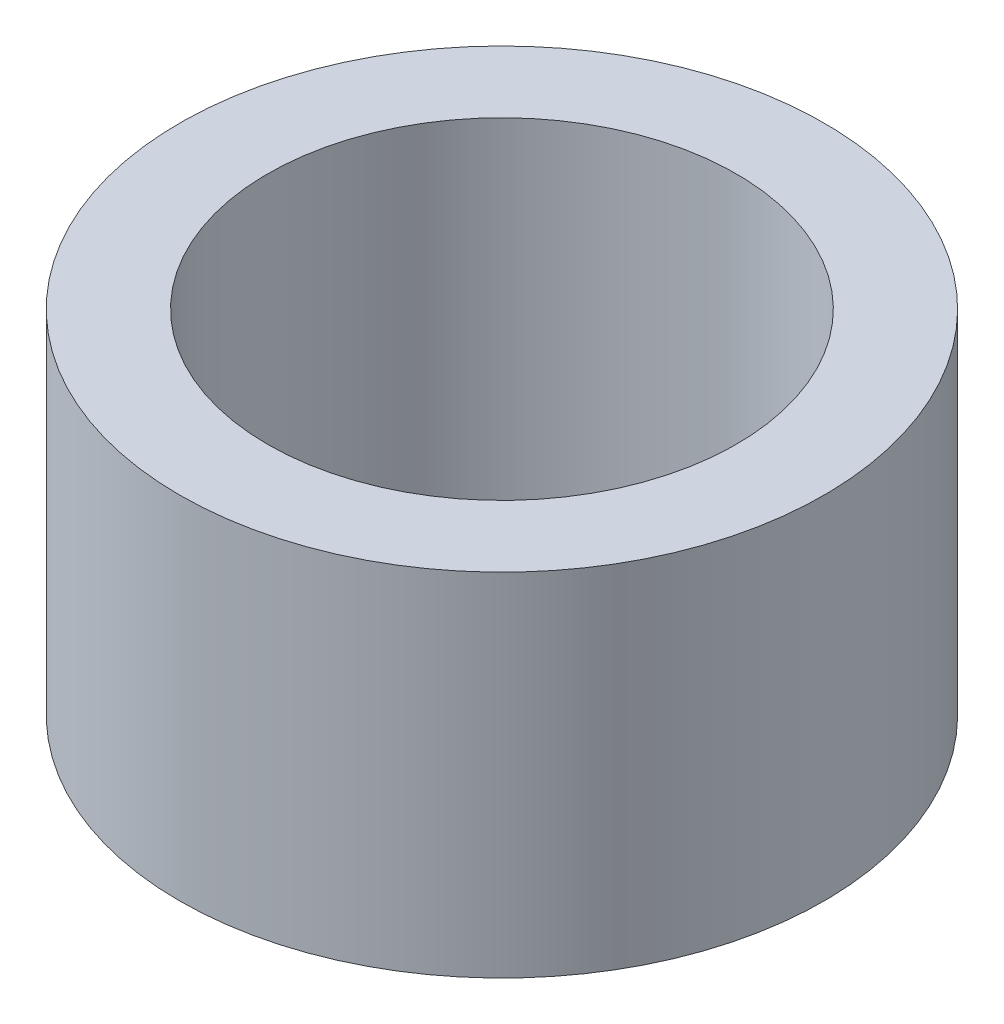
ISO-10303-21;
HEADER;
FILE_DESCRIPTION(('STEP AP214'),'2;1');
FILE_NAME('part.step','',(''),(''),'','','');
FILE_SCHEMA(('AUTOMOTIVE_DESIGN { 1 0 10303 214 1 1 1 1 }'));
ENDSEC;
DATA;
#1=APPLICATION_CONTEXT('core data for automotive mechanical design processes');
#2=APPLICATION_PROTOCOL_DEFINITION('international standard','automotive_design',2000,#1);
#3=PRODUCT_CONTEXT('',#1,'mechanical');
#4=PRODUCT('Part','Part','',(#3));
#5=PRODUCT_RELATED_PRODUCT_CATEGORY('part','',(#4));
#6=PRODUCT_DEFINITION_FORMATION('','',#4);
#7=PRODUCT_DEFINITION_CONTEXT('part definition',#1,'design');
#8=PRODUCT_DEFINITION('design','',#6,#7);
#9=PRODUCT_DEFINITION_SHAPE('','',#8);
#10=(LENGTH_UNIT() NAMED_UNIT(*) SI_UNIT(.MILLI.,.METRE.));
#11=(NAMED_UNIT(*) PLANE_ANGLE_UNIT() SI_UNIT($,.RADIAN.));
#12=(NAMED_UNIT(*) SI_UNIT($,.STERADIAN.) SOLID_ANGLE_UNIT());
#13=UNCERTAINTY_MEASURE_WITH_UNIT(LENGTH_MEASURE(1.E-05),#10,'distance_accuracy_value','');
#14=(GEOMETRIC_REPRESENTATION_CONTEXT(3) GLOBAL_UNCERTAINTY_ASSIGNED_CONTEXT((#13)) GLOBAL_UNIT_ASSIGNED_CONTEXT((#10,
#11,#12)) REPRESENTATION_CONTEXT('',''));
#15=CARTESIAN_POINT('',(0.,0.,0.));
#16=DIRECTION('',(0.,0.,1.));
#17=DIRECTION('',(1.,0.,0.));
#18=AXIS2_PLACEMENT_3D('',#15,#16,#17);
#19=CARTESIAN_POINT('',(0.,3.,0.));
#20=DIRECTION('',(0.,1.,0.));
#21=DIRECTION('',(0.,0.,1.));
#22=AXIS2_PLACEMENT_3D('',#19,#20,#21);
#23=PLANE('',#22);
#24=CARTESIAN_POINT('',(0.,3.,0.));
#25=DIRECTION('',(0.,1.,0.));
#26=DIRECTION('',(0.,0.,1.));
#27=AXIS2_PLACEMENT_3D('',#24,#25,#26);
#28=CIRCLE('',#27,2.75);
#29=CARTESIAN_POINT('',(0.,3.,2.75));
#30=VERTEX_POINT('',#29);
#31=EDGE_CURVE('E10',#30,#30,#28,.T.);
#32=ORIENTED_EDGE('',*,*,#31,.T.);
#33=EDGE_LOOP('',(#32));
#34=FACE_BOUND('',#33,.T.);
#35=CARTESIAN_POINT('',(0.,3.,0.));
#36=DIRECTION('',(0.,1.,0.));
#37=DIRECTION('',(0.,0.,1.));
#38=AXIS2_PLACEMENT_3D('',#35,#36,#37);
#39=CIRCLE('',#38,2.);
#40=CARTESIAN_POINT('',(0.,3.,2.));
#41=VERTEX_POINT('',#40);
#42=EDGE_CURVE('E42',#41,#41,#39,.T.);
#43=ORIENTED_EDGE('',*,*,#42,.F.);
#44=EDGE_LOOP('',(#43));
#45=FACE_BOUND('',#44,.T.);
#46=ADVANCED_FACE('F31',(#34,#45),#23,.T.);
#47=CARTESIAN_POINT('',(0.,0.,0.));
#48=DIRECTION('',(0.,1.,0.));
#49=DIRECTION('',(0.,0.,1.));
#50=AXIS2_PLACEMENT_3D('',#47,#48,#49);
#51=PLANE('',#50);
#52=CARTESIAN_POINT('',(0.,0.,0.));
#53=DIRECTION('',(0.,1.,0.));
#54=DIRECTION('',(0.,0.,1.));
#55=AXIS2_PLACEMENT_3D('',#52,#53,#54);
#56=CIRCLE('',#55,2.75);
#57=CARTESIAN_POINT('',(0.,0.,2.75));
#58=VERTEX_POINT('',#57);
#59=EDGE_CURVE('E35',#58,#58,#56,.T.);
#60=ORIENTED_EDGE('',*,*,#59,.F.);
#61=EDGE_LOOP('',(#60));
#62=FACE_BOUND('',#61,.T.);
#63=CARTESIAN_POINT('',(0.,0.,0.));
#64=DIRECTION('',(0.,1.,0.));
#65=DIRECTION('',(0.,0.,1.));
#66=AXIS2_PLACEMENT_3D('',#63,#64,#65);
#67=CIRCLE('',#66,2.);
#68=CARTESIAN_POINT('',(0.,0.,2.));
#69=VERTEX_POINT('',#68);
#70=EDGE_CURVE('E44',#69,#69,#67,.T.);
#71=ORIENTED_EDGE('',*,*,#70,.T.);
#72=EDGE_LOOP('',(#71));
#73=FACE_BOUND('',#72,.T.);
#74=ADVANCED_FACE('F54',(#62,#73),#51,.F.);
#75=CARTESIAN_POINT('',(0.,3.,0.));
#76=DIRECTION('',(0.,-1.,0.));
#77=DIRECTION('',(0.,0.,-1.));
#78=AXIS2_PLACEMENT_3D('',#75,#76,#77);
#79=CYLINDRICAL_SURFACE('',#78,2.75);
#80=ORIENTED_EDGE('',*,*,#31,.F.);
#81=EDGE_LOOP('',(#80));
#82=FACE_BOUND('',#81,.T.);
#83=ORIENTED_EDGE('',*,*,#59,.T.);
#84=EDGE_LOOP('',(#83));
#85=FACE_BOUND('',#84,.T.);
#86=ADVANCED_FACE('F33',(#82,#85),#79,.T.);
#87=CARTESIAN_POINT('',(0.,3.,0.));
#88=DIRECTION('',(0.,-1.,0.));
#89=DIRECTION('',(0.,0.,-1.));
#90=AXIS2_PLACEMENT_3D('',#87,#88,#89);
#91=CYLINDRICAL_SURFACE('',#90,2.);
#92=ORIENTED_EDGE('',*,*,#42,.T.);
#93=EDGE_LOOP('',(#92));
#94=FACE_BOUND('',#93,.T.);
#95=ORIENTED_EDGE('',*,*,#70,.F.);
#96=EDGE_LOOP('',(#95));
#97=FACE_BOUND('',#96,.T.);
#98=ADVANCED_FACE('F50',(#94,#97),#91,.F.);
#99=CLOSED_SHELL('',(#46,#74,#86,#98));
#100=MANIFOLD_SOLID_BREP('B2',#99);
#101=ADVANCED_BREP_SHAPE_REPRESENTATION('',(#18,#100),#14);
#102=SHAPE_DEFINITION_REPRESENTATION(#9,#101);
ENDSEC;
END-ISO-10303-21;
